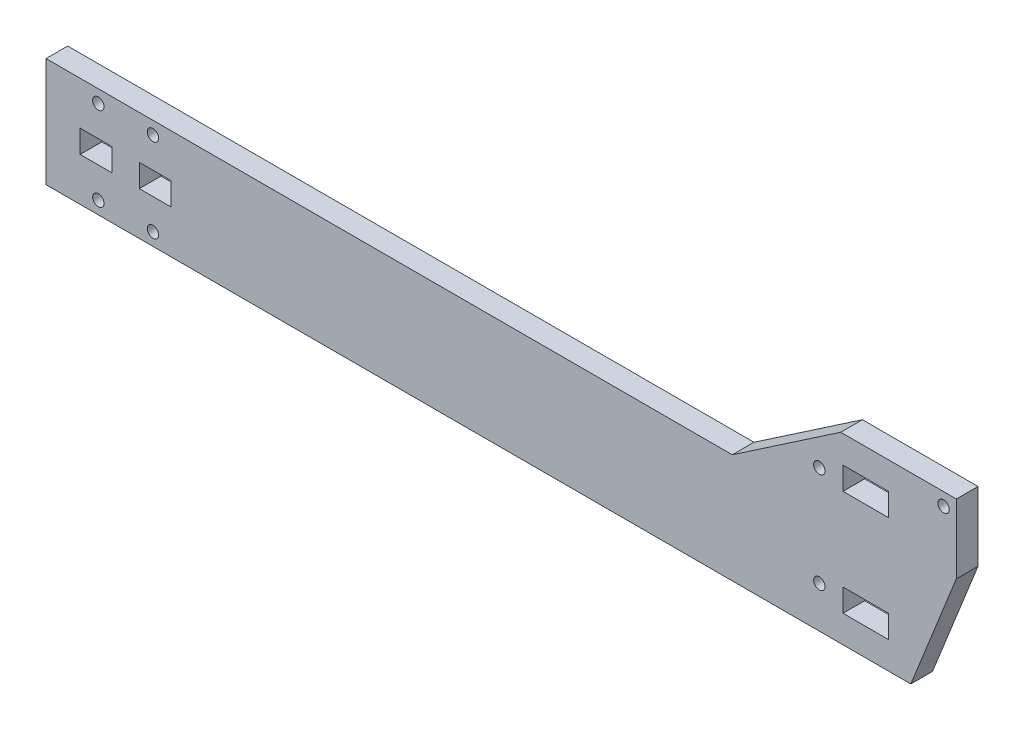
ISO-10303-21;
HEADER;
FILE_DESCRIPTION(('STEP AP214'),'2;1');
FILE_NAME('part.step','',(''),(''),'','','');
FILE_SCHEMA(('AUTOMOTIVE_DESIGN { 1 0 10303 214 1 1 1 1 }'));
ENDSEC;
DATA;
#1=APPLICATION_CONTEXT('core data for automotive mechanical design processes');
#2=APPLICATION_PROTOCOL_DEFINITION('international standard','automotive_design',2000,#1);
#3=PRODUCT_CONTEXT('',#1,'mechanical');
#4=PRODUCT('Part','Part','',(#3));
#5=PRODUCT_RELATED_PRODUCT_CATEGORY('part','',(#4));
#6=PRODUCT_DEFINITION_FORMATION('','',#4);
#7=PRODUCT_DEFINITION_CONTEXT('part definition',#1,'design');
#8=PRODUCT_DEFINITION('design','',#6,#7);
#9=PRODUCT_DEFINITION_SHAPE('','',#8);
#10=(LENGTH_UNIT() NAMED_UNIT(*) SI_UNIT(.MILLI.,.METRE.));
#11=(NAMED_UNIT(*) PLANE_ANGLE_UNIT() SI_UNIT($,.RADIAN.));
#12=(NAMED_UNIT(*) SI_UNIT($,.STERADIAN.) SOLID_ANGLE_UNIT());
#13=UNCERTAINTY_MEASURE_WITH_UNIT(LENGTH_MEASURE(1.E-05),#10,'distance_accuracy_value','');
#14=(GEOMETRIC_REPRESENTATION_CONTEXT(3) GLOBAL_UNCERTAINTY_ASSIGNED_CONTEXT((#13)) GLOBAL_UNIT_ASSIGNED_CONTEXT((#10,
#11,#12)) REPRESENTATION_CONTEXT('',''));
#15=CARTESIAN_POINT('',(0.,0.,0.));
#16=DIRECTION('',(0.,0.,1.));
#17=DIRECTION('',(1.,0.,0.));
#18=AXIS2_PLACEMENT_3D('',#15,#16,#17);
#19=CARTESIAN_POINT('',(0.,24.,4.7625));
#20=DIRECTION('',(1.,0.,0.));
#21=DIRECTION('',(0.,1.,0.));
#22=AXIS2_PLACEMENT_3D('',#19,#20,#21);
#23=PLANE('',#22);
#24=DIRECTION('',(0.,-1.,0.));
#25=VECTOR('',#24,1.);
#26=CARTESIAN_POINT('',(0.,24.,0.));
#27=LINE('',#26,#25);
#28=CARTESIAN_POINT('',(0.,24.,0.));
#29=VERTEX_POINT('',#28);
#30=CARTESIAN_POINT('',(0.,0.,0.));
#31=VERTEX_POINT('',#30);
#32=EDGE_CURVE('E318',#29,#31,#27,.T.);
#33=ORIENTED_EDGE('',*,*,#32,.T.);
#34=DIRECTION('',(0.,0.,-1.));
#35=VECTOR('',#34,1.);
#36=CARTESIAN_POINT('',(0.,0.,4.7625));
#37=LINE('',#36,#35);
#38=CARTESIAN_POINT('',(0.,0.,4.7625));
#39=VERTEX_POINT('',#38);
#40=EDGE_CURVE('E11',#39,#31,#37,.T.);
#41=ORIENTED_EDGE('',*,*,#40,.F.);
#42=DIRECTION('',(0.,-1.,0.));
#43=VECTOR('',#42,1.);
#44=CARTESIAN_POINT('',(0.,24.,4.7625));
#45=LINE('',#44,#43);
#46=CARTESIAN_POINT('',(0.,24.,4.7625));
#47=VERTEX_POINT('',#46);
#48=EDGE_CURVE('E325',#47,#39,#45,.T.);
#49=ORIENTED_EDGE('',*,*,#48,.F.);
#50=DIRECTION('',(0.,0.,-1.));
#51=VECTOR('',#50,1.);
#52=CARTESIAN_POINT('',(0.,24.,4.7625));
#53=LINE('',#52,#51);
#54=EDGE_CURVE('E341',#47,#29,#53,.T.);
#55=ORIENTED_EDGE('',*,*,#54,.T.);
#56=EDGE_LOOP('',(#33,#41,#49,#55));
#57=FACE_BOUND('',#56,.T.);
#58=ADVANCED_FACE('F34',(#57),#23,.F.);
#59=CARTESIAN_POINT('',(190.,0.,4.7625));
#60=DIRECTION('',(0.,1.,0.));
#61=DIRECTION('',(-1.,0.,0.));
#62=AXIS2_PLACEMENT_3D('',#59,#60,#61);
#63=PLANE('',#62);
#64=DIRECTION('',(1.,0.,0.));
#65=VECTOR('',#64,1.);
#66=CARTESIAN_POINT('',(190.,0.,0.));
#67=LINE('',#66,#65);
#68=CARTESIAN_POINT('',(190.,0.,0.));
#69=VERTEX_POINT('',#68);
#70=EDGE_CURVE('E344',#31,#69,#67,.T.);
#71=ORIENTED_EDGE('',*,*,#70,.T.);
#72=DIRECTION('',(0.,0.,-1.));
#73=VECTOR('',#72,1.);
#74=CARTESIAN_POINT('',(190.,0.,4.7625));
#75=LINE('',#74,#73);
#76=CARTESIAN_POINT('',(190.,0.,4.7625));
#77=VERTEX_POINT('',#76);
#78=EDGE_CURVE('E41',#77,#69,#75,.T.);
#79=ORIENTED_EDGE('',*,*,#78,.F.);
#80=DIRECTION('',(1.,0.,0.));
#81=VECTOR('',#80,1.);
#82=CARTESIAN_POINT('',(190.,0.,4.7625));
#83=LINE('',#82,#81);
#84=EDGE_CURVE('E328',#39,#77,#83,.T.);
#85=ORIENTED_EDGE('',*,*,#84,.F.);
#86=ORIENTED_EDGE('',*,*,#40,.T.);
#87=EDGE_LOOP('',(#71,#79,#85,#86));
#88=FACE_BOUND('',#87,.T.);
#89=ADVANCED_FACE('F395',(#88),#63,.F.);
#90=CARTESIAN_POINT('',(200.,25.,4.7625));
#91=DIRECTION('',(-0.928476690885259,0.371390676354104,0.));
#92=DIRECTION('',(-0.371390676354104,-0.928476690885259,0.));
#93=AXIS2_PLACEMENT_3D('',#90,#91,#92);
#94=PLANE('',#93);
#95=DIRECTION('',(0.371390676354104,0.928476690885259,0.));
#96=VECTOR('',#95,1.);
#97=CARTESIAN_POINT('',(200.,25.,0.));
#98=LINE('',#97,#96);
#99=CARTESIAN_POINT('',(200.,25.,0.));
#100=VERTEX_POINT('',#99);
#101=EDGE_CURVE('E346',#69,#100,#98,.T.);
#102=ORIENTED_EDGE('',*,*,#101,.T.);
#103=DIRECTION('',(0.,0.,-1.));
#104=VECTOR('',#103,1.);
#105=CARTESIAN_POINT('',(200.,25.,4.7625));
#106=LINE('',#105,#104);
#107=CARTESIAN_POINT('',(200.,25.,4.7625));
#108=VERTEX_POINT('',#107);
#109=EDGE_CURVE('E366',#108,#100,#106,.T.);
#110=ORIENTED_EDGE('',*,*,#109,.F.);
#111=DIRECTION('',(0.371390676354104,0.928476690885259,0.));
#112=VECTOR('',#111,1.);
#113=CARTESIAN_POINT('',(200.,25.,4.7625));
#114=LINE('',#113,#112);
#115=EDGE_CURVE('E331',#77,#108,#114,.T.);
#116=ORIENTED_EDGE('',*,*,#115,.F.);
#117=ORIENTED_EDGE('',*,*,#78,.T.);
#118=EDGE_LOOP('',(#102,#110,#116,#117));
#119=FACE_BOUND('',#118,.T.);
#120=ADVANCED_FACE('F373',(#119),#94,.F.);
#121=CARTESIAN_POINT('',(200.,40.2,4.7625));
#122=DIRECTION('',(-1.,0.,0.));
#123=DIRECTION('',(0.,0.,1.));
#124=AXIS2_PLACEMENT_3D('',#121,#122,#123);
#125=PLANE('',#124);
#126=DIRECTION('',(0.,1.,0.));
#127=VECTOR('',#126,1.);
#128=CARTESIAN_POINT('',(200.,40.2,0.));
#129=LINE('',#128,#127);
#130=CARTESIAN_POINT('',(200.,40.2,0.));
#131=VERTEX_POINT('',#130);
#132=EDGE_CURVE('E348',#100,#131,#129,.T.);
#133=ORIENTED_EDGE('',*,*,#132,.T.);
#134=DIRECTION('',(0.,0.,-1.));
#135=VECTOR('',#134,1.);
#136=CARTESIAN_POINT('',(200.,40.2,4.7625));
#137=LINE('',#136,#135);
#138=CARTESIAN_POINT('',(200.,40.2,4.7625));
#139=VERTEX_POINT('',#138);
#140=EDGE_CURVE('E363',#139,#131,#137,.T.);
#141=ORIENTED_EDGE('',*,*,#140,.F.);
#142=DIRECTION('',(0.,1.,0.));
#143=VECTOR('',#142,1.);
#144=CARTESIAN_POINT('',(200.,40.2,4.7625));
#145=LINE('',#144,#143);
#146=EDGE_CURVE('E333',#108,#139,#145,.T.);
#147=ORIENTED_EDGE('',*,*,#146,.F.);
#148=ORIENTED_EDGE('',*,*,#109,.T.);
#149=EDGE_LOOP('',(#133,#141,#147,#148));
#150=FACE_BOUND('',#149,.T.);
#151=ADVANCED_FACE('F383',(#150),#125,.F.);
#152=CARTESIAN_POINT('',(174.6,40.2,4.7625));
#153=DIRECTION('',(0.,-1.,0.));
#154=DIRECTION('',(0.,0.,-1.));
#155=AXIS2_PLACEMENT_3D('',#152,#153,#154);
#156=PLANE('',#155);
#157=DIRECTION('',(-1.,0.,0.));
#158=VECTOR('',#157,1.);
#159=CARTESIAN_POINT('',(174.6,40.2,0.));
#160=LINE('',#159,#158);
#161=CARTESIAN_POINT('',(174.6,40.2,0.));
#162=VERTEX_POINT('',#161);
#163=EDGE_CURVE('E350',#131,#162,#160,.T.);
#164=ORIENTED_EDGE('',*,*,#163,.T.);
#165=DIRECTION('',(0.,0.,-1.));
#166=VECTOR('',#165,1.);
#167=CARTESIAN_POINT('',(174.6,40.2,4.7625));
#168=LINE('',#167,#166);
#169=CARTESIAN_POINT('',(174.6,40.2,4.7625));
#170=VERTEX_POINT('',#169);
#171=EDGE_CURVE('E360',#170,#162,#168,.T.);
#172=ORIENTED_EDGE('',*,*,#171,.F.);
#173=DIRECTION('',(-1.,0.,0.));
#174=VECTOR('',#173,1.);
#175=CARTESIAN_POINT('',(174.6,40.2,4.7625));
#176=LINE('',#175,#174);
#177=EDGE_CURVE('E335',#139,#170,#176,.T.);
#178=ORIENTED_EDGE('',*,*,#177,.F.);
#179=ORIENTED_EDGE('',*,*,#140,.T.);
#180=EDGE_LOOP('',(#164,#172,#178,#179));
#181=FACE_BOUND('',#180,.T.);
#182=ADVANCED_FACE('F387',(#181),#156,.F.);
#183=CARTESIAN_POINT('',(174.6,40.2,4.7625));
#184=DIRECTION('',(0.562310021407278,-0.826926502069529,0.));
#185=DIRECTION('',(0.826926502069529,0.562310021407278,0.));
#186=AXIS2_PLACEMENT_3D('',#183,#184,#185);
#187=PLANE('',#186);
#188=DIRECTION('',(-0.826926502069529,-0.562310021407278,0.));
#189=VECTOR('',#188,1.);
#190=CARTESIAN_POINT('',(174.6,40.2,0.));
#191=LINE('',#190,#189);
#192=CARTESIAN_POINT('',(150.776470588235,24.,0.));
#193=VERTEX_POINT('',#192);
#194=EDGE_CURVE('E352',#162,#193,#191,.T.);
#195=ORIENTED_EDGE('',*,*,#194,.T.);
#196=DIRECTION('',(0.,0.,-1.));
#197=VECTOR('',#196,1.);
#198=CARTESIAN_POINT('',(150.776470588235,24.,4.7625));
#199=LINE('',#198,#197);
#200=CARTESIAN_POINT('',(150.776470588235,24.,4.7625));
#201=VERTEX_POINT('',#200);
#202=EDGE_CURVE('E357',#201,#193,#199,.T.);
#203=ORIENTED_EDGE('',*,*,#202,.F.);
#204=DIRECTION('',(-0.826926502069529,-0.562310021407278,0.));
#205=VECTOR('',#204,1.);
#206=CARTESIAN_POINT('',(174.6,40.2,4.7625));
#207=LINE('',#206,#205);
#208=EDGE_CURVE('E337',#170,#201,#207,.T.);
#209=ORIENTED_EDGE('',*,*,#208,.F.);
#210=ORIENTED_EDGE('',*,*,#171,.T.);
#211=EDGE_LOOP('',(#195,#203,#209,#210));
#212=FACE_BOUND('',#211,.T.);
#213=ADVANCED_FACE('F403',(#212),#187,.F.);
#214=CARTESIAN_POINT('',(150.776470588235,24.,4.7625));
#215=DIRECTION('',(0.,-1.,0.));
#216=DIRECTION('',(1.,0.,0.));
#217=AXIS2_PLACEMENT_3D('',#214,#215,#216);
#218=PLANE('',#217);
#219=DIRECTION('',(-1.,0.,0.));
#220=VECTOR('',#219,1.);
#221=CARTESIAN_POINT('',(150.776470588235,24.,0.));
#222=LINE('',#221,#220);
#223=EDGE_CURVE('E329',#193,#29,#222,.T.);
#224=ORIENTED_EDGE('',*,*,#223,.T.);
#225=ORIENTED_EDGE('',*,*,#54,.F.);
#226=DIRECTION('',(-1.,0.,0.));
#227=VECTOR('',#226,1.);
#228=CARTESIAN_POINT('',(150.776470588235,24.,4.7625));
#229=LINE('',#228,#227);
#230=EDGE_CURVE('E339',#201,#47,#229,.T.);
#231=ORIENTED_EDGE('',*,*,#230,.F.);
#232=ORIENTED_EDGE('',*,*,#202,.T.);
#233=EDGE_LOOP('',(#224,#225,#231,#232));
#234=FACE_BOUND('',#233,.T.);
#235=ADVANCED_FACE('F400',(#234),#218,.F.);
#236=CARTESIAN_POINT('',(0.,0.,4.7625));
#237=DIRECTION('',(0.,0.,-1.));
#238=DIRECTION('',(-1.,0.,0.));
#239=AXIS2_PLACEMENT_3D('',#236,#237,#238);
#240=PLANE('',#239);
#241=CARTESIAN_POINT('',(23.5,2.79999999999998,4.7625));
#242=DIRECTION('',(0.,0.,1.));
#243=DIRECTION('',(1.,0.,0.));
#244=AXIS2_PLACEMENT_3D('',#241,#242,#243);
#245=CIRCLE('',#244,1.25);
#246=CARTESIAN_POINT('',(24.75,2.79999999999998,4.7625));
#247=VERTEX_POINT('',#246);
#248=EDGE_CURVE('E693',#247,#247,#245,.T.);
#249=ORIENTED_EDGE('',*,*,#248,.F.);
#250=EDGE_LOOP('',(#249));
#251=FACE_BOUND('',#250,.T.);
#252=CARTESIAN_POINT('',(11.5,2.79999999999998,4.7625));
#253=DIRECTION('',(0.,0.,1.));
#254=DIRECTION('',(1.,0.,0.));
#255=AXIS2_PLACEMENT_3D('',#252,#253,#254);
#256=CIRCLE('',#255,1.25);
#257=CARTESIAN_POINT('',(12.75,2.79999999999998,4.7625));
#258=VERTEX_POINT('',#257);
#259=EDGE_CURVE('E695',#258,#258,#256,.T.);
#260=ORIENTED_EDGE('',*,*,#259,.F.);
#261=EDGE_LOOP('',(#260));
#262=FACE_BOUND('',#261,.T.);
#263=CARTESIAN_POINT('',(11.5,21.2,4.7625));
#264=DIRECTION('',(0.,0.,1.));
#265=DIRECTION('',(1.,0.,0.));
#266=AXIS2_PLACEMENT_3D('',#263,#264,#265);
#267=CIRCLE('',#266,1.25);
#268=CARTESIAN_POINT('',(12.75,21.2,4.7625));
#269=VERTEX_POINT('',#268);
#270=EDGE_CURVE('E701',#269,#269,#267,.T.);
#271=ORIENTED_EDGE('',*,*,#270,.F.);
#272=EDGE_LOOP('',(#271));
#273=FACE_BOUND('',#272,.T.);
#274=CARTESIAN_POINT('',(23.5,21.2,4.7625));
#275=DIRECTION('',(0.,0.,1.));
#276=DIRECTION('',(1.,0.,0.));
#277=AXIS2_PLACEMENT_3D('',#274,#275,#276);
#278=CIRCLE('',#277,1.25);
#279=CARTESIAN_POINT('',(24.75,21.2,4.7625));
#280=VERTEX_POINT('',#279);
#281=EDGE_CURVE('E707',#280,#280,#278,.T.);
#282=ORIENTED_EDGE('',*,*,#281,.F.);
#283=EDGE_LOOP('',(#282));
#284=FACE_BOUND('',#283,.T.);
#285=CARTESIAN_POINT('',(169.9,9.1,4.7625));
#286=DIRECTION('',(0.,0.,1.));
#287=DIRECTION('',(1.,0.,0.));
#288=AXIS2_PLACEMENT_3D('',#285,#286,#287);
#289=CIRCLE('',#288,1.25000000000001);
#290=CARTESIAN_POINT('',(171.15,9.1,4.7625));
#291=VERTEX_POINT('',#290);
#292=EDGE_CURVE('E713',#291,#291,#289,.T.);
#293=ORIENTED_EDGE('',*,*,#292,.F.);
#294=EDGE_LOOP('',(#293));
#295=FACE_BOUND('',#294,.T.);
#296=CARTESIAN_POINT('',(197.2,37.4,4.7625));
#297=DIRECTION('',(0.,0.,1.));
#298=DIRECTION('',(1.,0.,0.));
#299=AXIS2_PLACEMENT_3D('',#296,#297,#298);
#300=CIRCLE('',#299,1.25000000000001);
#301=CARTESIAN_POINT('',(198.45,37.4,4.7625));
#302=VERTEX_POINT('',#301);
#303=EDGE_CURVE('E719',#302,#302,#300,.T.);
#304=ORIENTED_EDGE('',*,*,#303,.F.);
#305=EDGE_LOOP('',(#304));
#306=FACE_BOUND('',#305,.T.);
#307=CARTESIAN_POINT('',(169.9,31.1,4.7625));
#308=DIRECTION('',(0.,0.,1.));
#309=DIRECTION('',(1.,0.,0.));
#310=AXIS2_PLACEMENT_3D('',#307,#308,#309);
#311=CIRCLE('',#310,1.25000000000001);
#312=CARTESIAN_POINT('',(171.15,31.1,4.7625));
#313=VERTEX_POINT('',#312);
#314=EDGE_CURVE('E212',#313,#313,#311,.T.);
#315=ORIENTED_EDGE('',*,*,#314,.F.);
#316=EDGE_LOOP('',(#315));
#317=FACE_BOUND('',#316,.T.);
#318=DIRECTION('',(-1.,0.,0.));
#319=VECTOR('',#318,1.);
#320=CARTESIAN_POINT('',(20.5,14.5,4.7625));
#321=LINE('',#320,#319);
#322=CARTESIAN_POINT('',(27.5,14.5,4.7625));
#323=VERTEX_POINT('',#322);
#324=CARTESIAN_POINT('',(20.5,14.5,4.7625));
#325=VERTEX_POINT('',#324);
#326=EDGE_CURVE('E218',#323,#325,#321,.T.);
#327=ORIENTED_EDGE('',*,*,#326,.F.);
#328=DIRECTION('',(0.,1.,0.));
#329=VECTOR('',#328,1.);
#330=CARTESIAN_POINT('',(27.5,14.5,4.7625));
#331=LINE('',#330,#329);
#332=CARTESIAN_POINT('',(27.5,9.5,4.7625));
#333=VERTEX_POINT('',#332);
#334=EDGE_CURVE('E48',#333,#323,#331,.T.);
#335=ORIENTED_EDGE('',*,*,#334,.F.);
#336=DIRECTION('',(1.,0.,0.));
#337=VECTOR('',#336,1.);
#338=CARTESIAN_POINT('',(20.5,9.5,4.7625));
#339=LINE('',#338,#337);
#340=CARTESIAN_POINT('',(20.5,9.5,4.7625));
#341=VERTEX_POINT('',#340);
#342=EDGE_CURVE('E206',#341,#333,#339,.T.);
#343=ORIENTED_EDGE('',*,*,#342,.F.);
#344=DIRECTION('',(0.,-1.,0.));
#345=VECTOR('',#344,1.);
#346=CARTESIAN_POINT('',(20.5,14.5,4.7625));
#347=LINE('',#346,#345);
#348=EDGE_CURVE('E209',#325,#341,#347,.T.);
#349=ORIENTED_EDGE('',*,*,#348,.F.);
#350=EDGE_LOOP('',(#327,#335,#343,#349));
#351=FACE_BOUND('',#350,.T.);
#352=DIRECTION('',(-1.,0.,0.));
#353=VECTOR('',#352,1.);
#354=CARTESIAN_POINT('',(7.5,14.5,4.7625));
#355=LINE('',#354,#353);
#356=CARTESIAN_POINT('',(14.5,14.5,4.7625));
#357=VERTEX_POINT('',#356);
#358=CARTESIAN_POINT('',(7.5,14.5,4.7625));
#359=VERTEX_POINT('',#358);
#360=EDGE_CURVE('E244',#357,#359,#355,.T.);
#361=ORIENTED_EDGE('',*,*,#360,.F.);
#362=DIRECTION('',(0.,1.,0.));
#363=VECTOR('',#362,1.);
#364=CARTESIAN_POINT('',(14.5,14.5,4.7625));
#365=LINE('',#364,#363);
#366=CARTESIAN_POINT('',(14.5,9.5,4.7625));
#367=VERTEX_POINT('',#366);
#368=EDGE_CURVE('E225',#367,#357,#365,.T.);
#369=ORIENTED_EDGE('',*,*,#368,.F.);
#370=DIRECTION('',(1.,0.,0.));
#371=VECTOR('',#370,1.);
#372=CARTESIAN_POINT('',(7.5,9.5,4.7625));
#373=LINE('',#372,#371);
#374=CARTESIAN_POINT('',(7.5,9.5,4.7625));
#375=VERTEX_POINT('',#374);
#376=EDGE_CURVE('E233',#375,#367,#373,.T.);
#377=ORIENTED_EDGE('',*,*,#376,.F.);
#378=DIRECTION('',(0.,-1.,0.));
#379=VECTOR('',#378,1.);
#380=CARTESIAN_POINT('',(7.5,14.5,4.7625));
#381=LINE('',#380,#379);
#382=EDGE_CURVE('E247',#359,#375,#381,.T.);
#383=ORIENTED_EDGE('',*,*,#382,.F.);
#384=EDGE_LOOP('',(#361,#369,#377,#383));
#385=FACE_BOUND('',#384,.T.);
#386=DIRECTION('',(-1.,0.,0.));
#387=VECTOR('',#386,1.);
#388=CARTESIAN_POINT('',(175.1,11.,4.7625));
#389=LINE('',#388,#387);
#390=CARTESIAN_POINT('',(185.1,11.,4.7625));
#391=VERTEX_POINT('',#390);
#392=CARTESIAN_POINT('',(175.1,11.,4.7625));
#393=VERTEX_POINT('',#392);
#394=EDGE_CURVE('E276',#391,#393,#389,.T.);
#395=ORIENTED_EDGE('',*,*,#394,.F.);
#396=DIRECTION('',(0.,1.,0.));
#397=VECTOR('',#396,1.);
#398=CARTESIAN_POINT('',(185.1,11.,4.7625));
#399=LINE('',#398,#397);
#400=CARTESIAN_POINT('',(185.1,6.,4.7625));
#401=VERTEX_POINT('',#400);
#402=EDGE_CURVE('E254',#401,#391,#399,.T.);
#403=ORIENTED_EDGE('',*,*,#402,.F.);
#404=DIRECTION('',(1.,0.,0.));
#405=VECTOR('',#404,1.);
#406=CARTESIAN_POINT('',(175.1,6.,4.7625));
#407=LINE('',#406,#405);
#408=CARTESIAN_POINT('',(175.1,6.,4.7625));
#409=VERTEX_POINT('',#408);
#410=EDGE_CURVE('E265',#409,#401,#407,.T.);
#411=ORIENTED_EDGE('',*,*,#410,.F.);
#412=DIRECTION('',(0.,-1.,0.));
#413=VECTOR('',#412,1.);
#414=CARTESIAN_POINT('',(175.1,11.,4.7625));
#415=LINE('',#414,#413);
#416=EDGE_CURVE('E279',#393,#409,#415,.T.);
#417=ORIENTED_EDGE('',*,*,#416,.F.);
#418=EDGE_LOOP('',(#395,#403,#411,#417));
#419=FACE_BOUND('',#418,.T.);
#420=DIRECTION('',(-1.,0.,0.));
#421=VECTOR('',#420,1.);
#422=CARTESIAN_POINT('',(175.1,34.2,4.7625));
#423=LINE('',#422,#421);
#424=CARTESIAN_POINT('',(185.1,34.2,4.7625));
#425=VERTEX_POINT('',#424);
#426=CARTESIAN_POINT('',(175.1,34.2,4.7625));
#427=VERTEX_POINT('',#426);
#428=EDGE_CURVE('E308',#425,#427,#423,.T.);
#429=ORIENTED_EDGE('',*,*,#428,.F.);
#430=DIRECTION('',(0.,1.,0.));
#431=VECTOR('',#430,1.);
#432=CARTESIAN_POINT('',(185.1,29.2,4.7625));
#433=LINE('',#432,#431);
#434=CARTESIAN_POINT('',(185.1,29.2,4.7625));
#435=VERTEX_POINT('',#434);
#436=EDGE_CURVE('E286',#435,#425,#433,.T.);
#437=ORIENTED_EDGE('',*,*,#436,.F.);
#438=DIRECTION('',(1.,0.,0.));
#439=VECTOR('',#438,1.);
#440=CARTESIAN_POINT('',(175.1,29.2,4.7625));
#441=LINE('',#440,#439);
#442=CARTESIAN_POINT('',(175.1,29.2,4.7625));
#443=VERTEX_POINT('',#442);
#444=EDGE_CURVE('E297',#443,#435,#441,.T.);
#445=ORIENTED_EDGE('',*,*,#444,.F.);
#446=DIRECTION('',(0.,-1.,0.));
#447=VECTOR('',#446,1.);
#448=CARTESIAN_POINT('',(175.1,29.2,4.7625));
#449=LINE('',#448,#447);
#450=EDGE_CURVE('E311',#427,#443,#449,.T.);
#451=ORIENTED_EDGE('',*,*,#450,.F.);
#452=EDGE_LOOP('',(#429,#437,#445,#451));
#453=FACE_BOUND('',#452,.T.);
#454=ORIENTED_EDGE('',*,*,#48,.T.);
#455=ORIENTED_EDGE('',*,*,#84,.T.);
#456=ORIENTED_EDGE('',*,*,#115,.T.);
#457=ORIENTED_EDGE('',*,*,#146,.T.);
#458=ORIENTED_EDGE('',*,*,#177,.T.);
#459=ORIENTED_EDGE('',*,*,#208,.T.);
#460=ORIENTED_EDGE('',*,*,#230,.T.);
#461=EDGE_LOOP('',(#454,#455,#456,#457,#458,#459,#460));
#462=FACE_BOUND('',#461,.T.);
#463=ADVANCED_FACE('F391',(#251,#262,#273,#284,#295,#306,#317,#351,#385,#419,#453,#462),#240,.F.);
#464=CARTESIAN_POINT('',(0.,0.,0.));
#465=DIRECTION('',(0.,0.,-1.));
#466=DIRECTION('',(-1.,0.,0.));
#467=AXIS2_PLACEMENT_3D('',#464,#465,#466);
#468=PLANE('',#467);
#469=CARTESIAN_POINT('',(23.5,2.79999999999998,0.));
#470=DIRECTION('',(0.,0.,1.));
#471=DIRECTION('',(1.,0.,0.));
#472=AXIS2_PLACEMENT_3D('',#469,#470,#471);
#473=CIRCLE('',#472,1.25);
#474=CARTESIAN_POINT('',(24.75,2.79999999999998,0.));
#475=VERTEX_POINT('',#474);
#476=EDGE_CURVE('E690',#475,#475,#473,.T.);
#477=ORIENTED_EDGE('',*,*,#476,.T.);
#478=EDGE_LOOP('',(#477));
#479=FACE_BOUND('',#478,.T.);
#480=CARTESIAN_POINT('',(11.5,2.79999999999998,0.));
#481=DIRECTION('',(0.,0.,1.));
#482=DIRECTION('',(1.,0.,0.));
#483=AXIS2_PLACEMENT_3D('',#480,#481,#482);
#484=CIRCLE('',#483,1.25);
#485=CARTESIAN_POINT('',(12.75,2.79999999999998,0.));
#486=VERTEX_POINT('',#485);
#487=EDGE_CURVE('E698',#486,#486,#484,.T.);
#488=ORIENTED_EDGE('',*,*,#487,.T.);
#489=EDGE_LOOP('',(#488));
#490=FACE_BOUND('',#489,.T.);
#491=CARTESIAN_POINT('',(11.5,21.2,0.));
#492=DIRECTION('',(0.,0.,1.));
#493=DIRECTION('',(1.,0.,0.));
#494=AXIS2_PLACEMENT_3D('',#491,#492,#493);
#495=CIRCLE('',#494,1.25);
#496=CARTESIAN_POINT('',(12.75,21.2,0.));
#497=VERTEX_POINT('',#496);
#498=EDGE_CURVE('E704',#497,#497,#495,.T.);
#499=ORIENTED_EDGE('',*,*,#498,.T.);
#500=EDGE_LOOP('',(#499));
#501=FACE_BOUND('',#500,.T.);
#502=CARTESIAN_POINT('',(23.5,21.2,0.));
#503=DIRECTION('',(0.,0.,1.));
#504=DIRECTION('',(1.,0.,0.));
#505=AXIS2_PLACEMENT_3D('',#502,#503,#504);
#506=CIRCLE('',#505,1.25);
#507=CARTESIAN_POINT('',(24.75,21.2,0.));
#508=VERTEX_POINT('',#507);
#509=EDGE_CURVE('E710',#508,#508,#506,.T.);
#510=ORIENTED_EDGE('',*,*,#509,.T.);
#511=EDGE_LOOP('',(#510));
#512=FACE_BOUND('',#511,.T.);
#513=CARTESIAN_POINT('',(169.9,9.1,0.));
#514=DIRECTION('',(0.,0.,1.));
#515=DIRECTION('',(1.,0.,0.));
#516=AXIS2_PLACEMENT_3D('',#513,#514,#515);
#517=CIRCLE('',#516,1.25000000000001);
#518=CARTESIAN_POINT('',(171.15,9.1,0.));
#519=VERTEX_POINT('',#518);
#520=EDGE_CURVE('E716',#519,#519,#517,.T.);
#521=ORIENTED_EDGE('',*,*,#520,.T.);
#522=EDGE_LOOP('',(#521));
#523=FACE_BOUND('',#522,.T.);
#524=CARTESIAN_POINT('',(197.2,37.4,0.));
#525=DIRECTION('',(0.,0.,1.));
#526=DIRECTION('',(1.,0.,0.));
#527=AXIS2_PLACEMENT_3D('',#524,#525,#526);
#528=CIRCLE('',#527,1.25000000000001);
#529=CARTESIAN_POINT('',(198.45,37.4,0.));
#530=VERTEX_POINT('',#529);
#531=EDGE_CURVE('E722',#530,#530,#528,.T.);
#532=ORIENTED_EDGE('',*,*,#531,.T.);
#533=EDGE_LOOP('',(#532));
#534=FACE_BOUND('',#533,.T.);
#535=CARTESIAN_POINT('',(169.9,31.1,0.));
#536=DIRECTION('',(0.,0.,1.));
#537=DIRECTION('',(1.,0.,0.));
#538=AXIS2_PLACEMENT_3D('',#535,#536,#537);
#539=CIRCLE('',#538,1.25000000000001);
#540=CARTESIAN_POINT('',(171.15,31.1,0.));
#541=VERTEX_POINT('',#540);
#542=EDGE_CURVE('E219',#541,#541,#539,.T.);
#543=ORIENTED_EDGE('',*,*,#542,.T.);
#544=EDGE_LOOP('',(#543));
#545=FACE_BOUND('',#544,.T.);
#546=DIRECTION('',(0.,1.,0.));
#547=VECTOR('',#546,1.);
#548=CARTESIAN_POINT('',(27.5,14.5,0.));
#549=LINE('',#548,#547);
#550=CARTESIAN_POINT('',(27.5,9.5,0.));
#551=VERTEX_POINT('',#550);
#552=CARTESIAN_POINT('',(27.5,14.5,0.));
#553=VERTEX_POINT('',#552);
#554=EDGE_CURVE('E190',#551,#553,#549,.T.);
#555=ORIENTED_EDGE('',*,*,#554,.T.);
#556=DIRECTION('',(-1.,0.,0.));
#557=VECTOR('',#556,1.);
#558=CARTESIAN_POINT('',(20.5,14.5,0.));
#559=LINE('',#558,#557);
#560=CARTESIAN_POINT('',(20.5,14.5,0.));
#561=VERTEX_POINT('',#560);
#562=EDGE_CURVE('E199',#553,#561,#559,.T.);
#563=ORIENTED_EDGE('',*,*,#562,.T.);
#564=DIRECTION('',(0.,-1.,0.));
#565=VECTOR('',#564,1.);
#566=CARTESIAN_POINT('',(20.5,14.5,0.));
#567=LINE('',#566,#565);
#568=CARTESIAN_POINT('',(20.5,9.5,0.));
#569=VERTEX_POINT('',#568);
#570=EDGE_CURVE('E56',#561,#569,#567,.T.);
#571=ORIENTED_EDGE('',*,*,#570,.T.);
#572=DIRECTION('',(1.,0.,0.));
#573=VECTOR('',#572,1.);
#574=CARTESIAN_POINT('',(20.5,9.5,0.));
#575=LINE('',#574,#573);
#576=EDGE_CURVE('E196',#569,#551,#575,.T.);
#577=ORIENTED_EDGE('',*,*,#576,.T.);
#578=EDGE_LOOP('',(#555,#563,#571,#577));
#579=FACE_BOUND('',#578,.T.);
#580=DIRECTION('',(0.,1.,0.));
#581=VECTOR('',#580,1.);
#582=CARTESIAN_POINT('',(14.5,14.5,0.));
#583=LINE('',#582,#581);
#584=CARTESIAN_POINT('',(14.5,9.5,0.));
#585=VERTEX_POINT('',#584);
#586=CARTESIAN_POINT('',(14.5,14.5,0.));
#587=VERTEX_POINT('',#586);
#588=EDGE_CURVE('E229',#585,#587,#583,.T.);
#589=ORIENTED_EDGE('',*,*,#588,.T.);
#590=DIRECTION('',(-1.,0.,0.));
#591=VECTOR('',#590,1.);
#592=CARTESIAN_POINT('',(7.5,14.5,0.));
#593=LINE('',#592,#591);
#594=CARTESIAN_POINT('',(7.5,14.5,0.));
#595=VERTEX_POINT('',#594);
#596=EDGE_CURVE('E232',#587,#595,#593,.T.);
#597=ORIENTED_EDGE('',*,*,#596,.T.);
#598=DIRECTION('',(0.,-1.,0.));
#599=VECTOR('',#598,1.);
#600=CARTESIAN_POINT('',(7.5,14.5,0.));
#601=LINE('',#600,#599);
#602=CARTESIAN_POINT('',(7.5,9.5,0.));
#603=VERTEX_POINT('',#602);
#604=EDGE_CURVE('E236',#595,#603,#601,.T.);
#605=ORIENTED_EDGE('',*,*,#604,.T.);
#606=DIRECTION('',(1.,0.,0.));
#607=VECTOR('',#606,1.);
#608=CARTESIAN_POINT('',(7.5,9.5,0.));
#609=LINE('',#608,#607);
#610=EDGE_CURVE('E239',#603,#585,#609,.T.);
#611=ORIENTED_EDGE('',*,*,#610,.T.);
#612=EDGE_LOOP('',(#589,#597,#605,#611));
#613=FACE_BOUND('',#612,.T.);
#614=DIRECTION('',(0.,1.,0.));
#615=VECTOR('',#614,1.);
#616=CARTESIAN_POINT('',(185.1,11.,0.));
#617=LINE('',#616,#615);
#618=CARTESIAN_POINT('',(185.1,6.,0.));
#619=VERTEX_POINT('',#618);
#620=CARTESIAN_POINT('',(185.1,11.,0.));
#621=VERTEX_POINT('',#620);
#622=EDGE_CURVE('E261',#619,#621,#617,.T.);
#623=ORIENTED_EDGE('',*,*,#622,.T.);
#624=DIRECTION('',(-1.,0.,0.));
#625=VECTOR('',#624,1.);
#626=CARTESIAN_POINT('',(175.1,11.,0.));
#627=LINE('',#626,#625);
#628=CARTESIAN_POINT('',(175.1,11.,0.));
#629=VERTEX_POINT('',#628);
#630=EDGE_CURVE('E264',#621,#629,#627,.T.);
#631=ORIENTED_EDGE('',*,*,#630,.T.);
#632=DIRECTION('',(0.,-1.,0.));
#633=VECTOR('',#632,1.);
#634=CARTESIAN_POINT('',(175.1,11.,0.));
#635=LINE('',#634,#633);
#636=CARTESIAN_POINT('',(175.1,6.,0.));
#637=VERTEX_POINT('',#636);
#638=EDGE_CURVE('E268',#629,#637,#635,.T.);
#639=ORIENTED_EDGE('',*,*,#638,.T.);
#640=DIRECTION('',(1.,0.,0.));
#641=VECTOR('',#640,1.);
#642=CARTESIAN_POINT('',(175.1,6.,0.));
#643=LINE('',#642,#641);
#644=EDGE_CURVE('E271',#637,#619,#643,.T.);
#645=ORIENTED_EDGE('',*,*,#644,.T.);
#646=EDGE_LOOP('',(#623,#631,#639,#645));
#647=FACE_BOUND('',#646,.T.);
#648=DIRECTION('',(0.,1.,0.));
#649=VECTOR('',#648,1.);
#650=CARTESIAN_POINT('',(185.1,29.2,0.));
#651=LINE('',#650,#649);
#652=CARTESIAN_POINT('',(185.1,29.2,0.));
#653=VERTEX_POINT('',#652);
#654=CARTESIAN_POINT('',(185.1,34.2,0.));
#655=VERTEX_POINT('',#654);
#656=EDGE_CURVE('E293',#653,#655,#651,.T.);
#657=ORIENTED_EDGE('',*,*,#656,.T.);
#658=DIRECTION('',(-1.,0.,0.));
#659=VECTOR('',#658,1.);
#660=CARTESIAN_POINT('',(175.1,34.2,0.));
#661=LINE('',#660,#659);
#662=CARTESIAN_POINT('',(175.1,34.2,0.));
#663=VERTEX_POINT('',#662);
#664=EDGE_CURVE('E296',#655,#663,#661,.T.);
#665=ORIENTED_EDGE('',*,*,#664,.T.);
#666=DIRECTION('',(0.,-1.,0.));
#667=VECTOR('',#666,1.);
#668=CARTESIAN_POINT('',(175.1,29.2,0.));
#669=LINE('',#668,#667);
#670=CARTESIAN_POINT('',(175.1,29.2,0.));
#671=VERTEX_POINT('',#670);
#672=EDGE_CURVE('E300',#663,#671,#669,.T.);
#673=ORIENTED_EDGE('',*,*,#672,.T.);
#674=DIRECTION('',(1.,0.,0.));
#675=VECTOR('',#674,1.);
#676=CARTESIAN_POINT('',(175.1,29.2,0.));
#677=LINE('',#676,#675);
#678=EDGE_CURVE('E303',#671,#653,#677,.T.);
#679=ORIENTED_EDGE('',*,*,#678,.T.);
#680=EDGE_LOOP('',(#657,#665,#673,#679));
#681=FACE_BOUND('',#680,.T.);
#682=ORIENTED_EDGE('',*,*,#32,.F.);
#683=ORIENTED_EDGE('',*,*,#223,.F.);
#684=ORIENTED_EDGE('',*,*,#194,.F.);
#685=ORIENTED_EDGE('',*,*,#163,.F.);
#686=ORIENTED_EDGE('',*,*,#132,.F.);
#687=ORIENTED_EDGE('',*,*,#101,.F.);
#688=ORIENTED_EDGE('',*,*,#70,.F.);
#689=EDGE_LOOP('',(#682,#683,#684,#685,#686,#687,#688));
#690=FACE_BOUND('',#689,.T.);
#691=ADVANCED_FACE('F203',(#479,#490,#501,#512,#523,#534,#545,#579,#613,#647,#681,#690),#468,.T.);
#692=CARTESIAN_POINT('',(185.1,29.2,0.));
#693=DIRECTION('',(1.,0.,0.));
#694=DIRECTION('',(0.,0.,-1.));
#695=AXIS2_PLACEMENT_3D('',#692,#693,#694);
#696=PLANE('',#695);
#697=ORIENTED_EDGE('',*,*,#436,.T.);
#698=DIRECTION('',(0.,0.,1.));
#699=VECTOR('',#698,1.);
#700=CARTESIAN_POINT('',(185.1,34.2,0.));
#701=LINE('',#700,#699);
#702=EDGE_CURVE('E306',#655,#425,#701,.T.);
#703=ORIENTED_EDGE('',*,*,#702,.F.);
#704=ORIENTED_EDGE('',*,*,#656,.F.);
#705=DIRECTION('',(0.,0.,1.));
#706=VECTOR('',#705,1.);
#707=CARTESIAN_POINT('',(185.1,29.2,0.));
#708=LINE('',#707,#706);
#709=EDGE_CURVE('E316',#653,#435,#708,.T.);
#710=ORIENTED_EDGE('',*,*,#709,.T.);
#711=EDGE_LOOP('',(#697,#703,#704,#710));
#712=FACE_BOUND('',#711,.T.);
#713=ADVANCED_FACE('F458',(#712),#696,.F.);
#714=CARTESIAN_POINT('',(175.1,29.2,0.));
#715=DIRECTION('',(0.,-1.,0.));
#716=DIRECTION('',(0.,0.,-1.));
#717=AXIS2_PLACEMENT_3D('',#714,#715,#716);
#718=PLANE('',#717);
#719=ORIENTED_EDGE('',*,*,#444,.T.);
#720=ORIENTED_EDGE('',*,*,#709,.F.);
#721=ORIENTED_EDGE('',*,*,#678,.F.);
#722=DIRECTION('',(0.,0.,1.));
#723=VECTOR('',#722,1.);
#724=CARTESIAN_POINT('',(175.1,29.2,0.));
#725=LINE('',#724,#723);
#726=EDGE_CURVE('E319',#671,#443,#725,.T.);
#727=ORIENTED_EDGE('',*,*,#726,.T.);
#728=EDGE_LOOP('',(#719,#720,#721,#727));
#729=FACE_BOUND('',#728,.T.);
#730=ADVANCED_FACE('F468',(#729),#718,.F.);
#731=CARTESIAN_POINT('',(175.1,29.2,0.));
#732=DIRECTION('',(-1.,0.,0.));
#733=DIRECTION('',(0.,0.,1.));
#734=AXIS2_PLACEMENT_3D('',#731,#732,#733);
#735=PLANE('',#734);
#736=ORIENTED_EDGE('',*,*,#450,.T.);
#737=ORIENTED_EDGE('',*,*,#726,.F.);
#738=ORIENTED_EDGE('',*,*,#672,.F.);
#739=DIRECTION('',(0.,0.,1.));
#740=VECTOR('',#739,1.);
#741=CARTESIAN_POINT('',(175.1,34.2,0.));
#742=LINE('',#741,#740);
#743=EDGE_CURVE('E321',#663,#427,#742,.T.);
#744=ORIENTED_EDGE('',*,*,#743,.T.);
#745=EDGE_LOOP('',(#736,#737,#738,#744));
#746=FACE_BOUND('',#745,.T.);
#747=ADVANCED_FACE('F478',(#746),#735,.F.);
#748=CARTESIAN_POINT('',(175.1,34.2,0.));
#749=DIRECTION('',(0.,1.,0.));
#750=DIRECTION('',(-1.,0.,0.));
#751=AXIS2_PLACEMENT_3D('',#748,#749,#750);
#752=PLANE('',#751);
#753=ORIENTED_EDGE('',*,*,#428,.T.);
#754=ORIENTED_EDGE('',*,*,#743,.F.);
#755=ORIENTED_EDGE('',*,*,#664,.F.);
#756=ORIENTED_EDGE('',*,*,#702,.T.);
#757=EDGE_LOOP('',(#753,#754,#755,#756));
#758=FACE_BOUND('',#757,.T.);
#759=ADVANCED_FACE('F488',(#758),#752,.F.);
#760=CARTESIAN_POINT('',(185.1,11.,0.));
#761=DIRECTION('',(1.,0.,0.));
#762=DIRECTION('',(0.,0.,-1.));
#763=AXIS2_PLACEMENT_3D('',#760,#761,#762);
#764=PLANE('',#763);
#765=ORIENTED_EDGE('',*,*,#402,.T.);
#766=DIRECTION('',(0.,0.,1.));
#767=VECTOR('',#766,1.);
#768=CARTESIAN_POINT('',(185.1,11.,0.));
#769=LINE('',#768,#767);
#770=EDGE_CURVE('E274',#621,#391,#769,.T.);
#771=ORIENTED_EDGE('',*,*,#770,.F.);
#772=ORIENTED_EDGE('',*,*,#622,.F.);
#773=DIRECTION('',(0.,0.,1.));
#774=VECTOR('',#773,1.);
#775=CARTESIAN_POINT('',(185.1,6.,0.));
#776=LINE('',#775,#774);
#777=EDGE_CURVE('E284',#619,#401,#776,.T.);
#778=ORIENTED_EDGE('',*,*,#777,.T.);
#779=EDGE_LOOP('',(#765,#771,#772,#778));
#780=FACE_BOUND('',#779,.T.);
#781=ADVANCED_FACE('F498',(#780),#764,.F.);
#782=CARTESIAN_POINT('',(175.1,6.,0.));
#783=DIRECTION('',(0.,-1.,0.));
#784=DIRECTION('',(0.,0.,-1.));
#785=AXIS2_PLACEMENT_3D('',#782,#783,#784);
#786=PLANE('',#785);
#787=ORIENTED_EDGE('',*,*,#410,.T.);
#788=ORIENTED_EDGE('',*,*,#777,.F.);
#789=ORIENTED_EDGE('',*,*,#644,.F.);
#790=DIRECTION('',(0.,0.,1.));
#791=VECTOR('',#790,1.);
#792=CARTESIAN_POINT('',(175.1,6.,0.));
#793=LINE('',#792,#791);
#794=EDGE_CURVE('E287',#637,#409,#793,.T.);
#795=ORIENTED_EDGE('',*,*,#794,.T.);
#796=EDGE_LOOP('',(#787,#788,#789,#795));
#797=FACE_BOUND('',#796,.T.);
#798=ADVANCED_FACE('F508',(#797),#786,.F.);
#799=CARTESIAN_POINT('',(175.1,11.,0.));
#800=DIRECTION('',(-1.,0.,0.));
#801=DIRECTION('',(0.,0.,1.));
#802=AXIS2_PLACEMENT_3D('',#799,#800,#801);
#803=PLANE('',#802);
#804=ORIENTED_EDGE('',*,*,#416,.T.);
#805=ORIENTED_EDGE('',*,*,#794,.F.);
#806=ORIENTED_EDGE('',*,*,#638,.F.);
#807=DIRECTION('',(0.,0.,1.));
#808=VECTOR('',#807,1.);
#809=CARTESIAN_POINT('',(175.1,11.,0.));
#810=LINE('',#809,#808);
#811=EDGE_CURVE('E289',#629,#393,#810,.T.);
#812=ORIENTED_EDGE('',*,*,#811,.T.);
#813=EDGE_LOOP('',(#804,#805,#806,#812));
#814=FACE_BOUND('',#813,.T.);
#815=ADVANCED_FACE('F518',(#814),#803,.F.);
#816=CARTESIAN_POINT('',(175.1,11.,0.));
#817=DIRECTION('',(0.,1.,0.));
#818=DIRECTION('',(0.,0.,1.));
#819=AXIS2_PLACEMENT_3D('',#816,#817,#818);
#820=PLANE('',#819);
#821=ORIENTED_EDGE('',*,*,#394,.T.);
#822=ORIENTED_EDGE('',*,*,#811,.F.);
#823=ORIENTED_EDGE('',*,*,#630,.F.);
#824=ORIENTED_EDGE('',*,*,#770,.T.);
#825=EDGE_LOOP('',(#821,#822,#823,#824));
#826=FACE_BOUND('',#825,.T.);
#827=ADVANCED_FACE('F528',(#826),#820,.F.);
#828=CARTESIAN_POINT('',(14.5,14.5,0.));
#829=DIRECTION('',(1.,0.,0.));
#830=DIRECTION('',(0.,0.,-1.));
#831=AXIS2_PLACEMENT_3D('',#828,#829,#830);
#832=PLANE('',#831);
#833=ORIENTED_EDGE('',*,*,#368,.T.);
#834=DIRECTION('',(0.,0.,1.));
#835=VECTOR('',#834,1.);
#836=CARTESIAN_POINT('',(14.5,14.5,0.));
#837=LINE('',#836,#835);
#838=EDGE_CURVE('E242',#587,#357,#837,.T.);
#839=ORIENTED_EDGE('',*,*,#838,.F.);
#840=ORIENTED_EDGE('',*,*,#588,.F.);
#841=DIRECTION('',(0.,0.,1.));
#842=VECTOR('',#841,1.);
#843=CARTESIAN_POINT('',(14.5,9.5,0.));
#844=LINE('',#843,#842);
#845=EDGE_CURVE('E252',#585,#367,#844,.T.);
#846=ORIENTED_EDGE('',*,*,#845,.T.);
#847=EDGE_LOOP('',(#833,#839,#840,#846));
#848=FACE_BOUND('',#847,.T.);
#849=ADVANCED_FACE('F538',(#848),#832,.F.);
#850=CARTESIAN_POINT('',(7.5,9.5,0.));
#851=DIRECTION('',(0.,-1.,0.));
#852=DIRECTION('',(0.,0.,-1.));
#853=AXIS2_PLACEMENT_3D('',#850,#851,#852);
#854=PLANE('',#853);
#855=ORIENTED_EDGE('',*,*,#376,.T.);
#856=ORIENTED_EDGE('',*,*,#845,.F.);
#857=ORIENTED_EDGE('',*,*,#610,.F.);
#858=DIRECTION('',(0.,0.,1.));
#859=VECTOR('',#858,1.);
#860=CARTESIAN_POINT('',(7.5,9.5,0.));
#861=LINE('',#860,#859);
#862=EDGE_CURVE('E255',#603,#375,#861,.T.);
#863=ORIENTED_EDGE('',*,*,#862,.T.);
#864=EDGE_LOOP('',(#855,#856,#857,#863));
#865=FACE_BOUND('',#864,.T.);
#866=ADVANCED_FACE('F548',(#865),#854,.F.);
#867=CARTESIAN_POINT('',(7.5,14.5,0.));
#868=DIRECTION('',(-1.,0.,0.));
#869=DIRECTION('',(0.,-1.,0.));
#870=AXIS2_PLACEMENT_3D('',#867,#868,#869);
#871=PLANE('',#870);
#872=ORIENTED_EDGE('',*,*,#382,.T.);
#873=ORIENTED_EDGE('',*,*,#862,.F.);
#874=ORIENTED_EDGE('',*,*,#604,.F.);
#875=DIRECTION('',(0.,0.,1.));
#876=VECTOR('',#875,1.);
#877=CARTESIAN_POINT('',(7.5,14.5,0.));
#878=LINE('',#877,#876);
#879=EDGE_CURVE('E257',#595,#359,#878,.T.);
#880=ORIENTED_EDGE('',*,*,#879,.T.);
#881=EDGE_LOOP('',(#872,#873,#874,#880));
#882=FACE_BOUND('',#881,.T.);
#883=ADVANCED_FACE('F558',(#882),#871,.F.);
#884=CARTESIAN_POINT('',(7.5,14.5,0.));
#885=DIRECTION('',(0.,1.,0.));
#886=DIRECTION('',(0.,0.,1.));
#887=AXIS2_PLACEMENT_3D('',#884,#885,#886);
#888=PLANE('',#887);
#889=ORIENTED_EDGE('',*,*,#360,.T.);
#890=ORIENTED_EDGE('',*,*,#879,.F.);
#891=ORIENTED_EDGE('',*,*,#596,.F.);
#892=ORIENTED_EDGE('',*,*,#838,.T.);
#893=EDGE_LOOP('',(#889,#890,#891,#892));
#894=FACE_BOUND('',#893,.T.);
#895=ADVANCED_FACE('F568',(#894),#888,.F.);
#896=CARTESIAN_POINT('',(27.5,14.5,0.));
#897=DIRECTION('',(1.,0.,0.));
#898=DIRECTION('',(0.,0.,-1.));
#899=AXIS2_PLACEMENT_3D('',#896,#897,#898);
#900=PLANE('',#899);
#901=ORIENTED_EDGE('',*,*,#334,.T.);
#902=DIRECTION('',(0.,0.,1.));
#903=VECTOR('',#902,1.);
#904=CARTESIAN_POINT('',(27.5,14.5,0.));
#905=LINE('',#904,#903);
#906=EDGE_CURVE('E186',#553,#323,#905,.T.);
#907=ORIENTED_EDGE('',*,*,#906,.F.);
#908=ORIENTED_EDGE('',*,*,#554,.F.);
#909=DIRECTION('',(0.,0.,1.));
#910=VECTOR('',#909,1.);
#911=CARTESIAN_POINT('',(27.5,9.5,0.));
#912=LINE('',#911,#910);
#913=EDGE_CURVE('E223',#551,#333,#912,.T.);
#914=ORIENTED_EDGE('',*,*,#913,.T.);
#915=EDGE_LOOP('',(#901,#907,#908,#914));
#916=FACE_BOUND('',#915,.T.);
#917=ADVANCED_FACE('F188',(#916),#900,.F.);
#918=CARTESIAN_POINT('',(20.5,9.5,0.));
#919=DIRECTION('',(0.,-1.,0.));
#920=DIRECTION('',(0.,0.,-1.));
#921=AXIS2_PLACEMENT_3D('',#918,#919,#920);
#922=PLANE('',#921);
#923=ORIENTED_EDGE('',*,*,#342,.T.);
#924=ORIENTED_EDGE('',*,*,#913,.F.);
#925=ORIENTED_EDGE('',*,*,#576,.F.);
#926=DIRECTION('',(0.,0.,1.));
#927=VECTOR('',#926,1.);
#928=CARTESIAN_POINT('',(20.5,9.5,0.));
#929=LINE('',#928,#927);
#930=EDGE_CURVE('E226',#569,#341,#929,.T.);
#931=ORIENTED_EDGE('',*,*,#930,.T.);
#932=EDGE_LOOP('',(#923,#924,#925,#931));
#933=FACE_BOUND('',#932,.T.);
#934=ADVANCED_FACE('F587',(#933),#922,.F.);
#935=CARTESIAN_POINT('',(20.5,14.5,0.));
#936=DIRECTION('',(-1.,0.,0.));
#937=DIRECTION('',(0.,0.,1.));
#938=AXIS2_PLACEMENT_3D('',#935,#936,#937);
#939=PLANE('',#938);
#940=ORIENTED_EDGE('',*,*,#348,.T.);
#941=ORIENTED_EDGE('',*,*,#930,.F.);
#942=ORIENTED_EDGE('',*,*,#570,.F.);
#943=DIRECTION('',(0.,0.,1.));
#944=VECTOR('',#943,1.);
#945=CARTESIAN_POINT('',(20.5,14.5,0.));
#946=LINE('',#945,#944);
#947=EDGE_CURVE('E195',#561,#325,#946,.T.);
#948=ORIENTED_EDGE('',*,*,#947,.T.);
#949=EDGE_LOOP('',(#940,#941,#942,#948));
#950=FACE_BOUND('',#949,.T.);
#951=ADVANCED_FACE('F596',(#950),#939,.F.);
#952=CARTESIAN_POINT('',(20.5,14.5,0.));
#953=DIRECTION('',(0.,1.,0.));
#954=DIRECTION('',(0.,0.,1.));
#955=AXIS2_PLACEMENT_3D('',#952,#953,#954);
#956=PLANE('',#955);
#957=ORIENTED_EDGE('',*,*,#326,.T.);
#958=ORIENTED_EDGE('',*,*,#947,.F.);
#959=ORIENTED_EDGE('',*,*,#562,.F.);
#960=ORIENTED_EDGE('',*,*,#906,.T.);
#961=EDGE_LOOP('',(#957,#958,#959,#960));
#962=FACE_BOUND('',#961,.T.);
#963=ADVANCED_FACE('F200',(#962),#956,.F.);
#964=CARTESIAN_POINT('',(169.9,31.1,0.));
#965=DIRECTION('',(0.,0.,1.));
#966=DIRECTION('',(1.,0.,0.));
#967=AXIS2_PLACEMENT_3D('',#964,#965,#966);
#968=CYLINDRICAL_SURFACE('',#967,1.25000000000001);
#969=ORIENTED_EDGE('',*,*,#542,.F.);
#970=EDGE_LOOP('',(#969));
#971=FACE_BOUND('',#970,.T.);
#972=ORIENTED_EDGE('',*,*,#314,.T.);
#973=EDGE_LOOP('',(#972));
#974=FACE_BOUND('',#973,.T.);
#975=ADVANCED_FACE('F614',(#971,#974),#968,.F.);
#976=CARTESIAN_POINT('',(197.2,37.4,0.));
#977=DIRECTION('',(0.,0.,1.));
#978=DIRECTION('',(1.,0.,0.));
#979=AXIS2_PLACEMENT_3D('',#976,#977,#978);
#980=CYLINDRICAL_SURFACE('',#979,1.25000000000001);
#981=ORIENTED_EDGE('',*,*,#531,.F.);
#982=EDGE_LOOP('',(#981));
#983=FACE_BOUND('',#982,.T.);
#984=ORIENTED_EDGE('',*,*,#303,.T.);
#985=EDGE_LOOP('',(#984));
#986=FACE_BOUND('',#985,.T.);
#987=ADVANCED_FACE('F623',(#983,#986),#980,.F.);
#988=CARTESIAN_POINT('',(169.9,9.1,0.));
#989=DIRECTION('',(0.,0.,1.));
#990=DIRECTION('',(1.,0.,0.));
#991=AXIS2_PLACEMENT_3D('',#988,#989,#990);
#992=CYLINDRICAL_SURFACE('',#991,1.25000000000001);
#993=ORIENTED_EDGE('',*,*,#520,.F.);
#994=EDGE_LOOP('',(#993));
#995=FACE_BOUND('',#994,.T.);
#996=ORIENTED_EDGE('',*,*,#292,.T.);
#997=EDGE_LOOP('',(#996));
#998=FACE_BOUND('',#997,.T.);
#999=ADVANCED_FACE('F633',(#995,#998),#992,.F.);
#1000=CARTESIAN_POINT('',(23.5,21.2,0.));
#1001=DIRECTION('',(0.,0.,1.));
#1002=DIRECTION('',(1.,0.,0.));
#1003=AXIS2_PLACEMENT_3D('',#1000,#1001,#1002);
#1004=CYLINDRICAL_SURFACE('',#1003,1.25);
#1005=ORIENTED_EDGE('',*,*,#509,.F.);
#1006=EDGE_LOOP('',(#1005));
#1007=FACE_BOUND('',#1006,.T.);
#1008=ORIENTED_EDGE('',*,*,#281,.T.);
#1009=EDGE_LOOP('',(#1008));
#1010=FACE_BOUND('',#1009,.T.);
#1011=ADVANCED_FACE('F643',(#1007,#1010),#1004,.F.);
#1012=CARTESIAN_POINT('',(11.5,21.2,0.));
#1013=DIRECTION('',(0.,0.,1.));
#1014=DIRECTION('',(1.,0.,0.));
#1015=AXIS2_PLACEMENT_3D('',#1012,#1013,#1014);
#1016=CYLINDRICAL_SURFACE('',#1015,1.25);
#1017=ORIENTED_EDGE('',*,*,#498,.F.);
#1018=EDGE_LOOP('',(#1017));
#1019=FACE_BOUND('',#1018,.T.);
#1020=ORIENTED_EDGE('',*,*,#270,.T.);
#1021=EDGE_LOOP('',(#1020));
#1022=FACE_BOUND('',#1021,.T.);
#1023=ADVANCED_FACE('F653',(#1019,#1022),#1016,.F.);
#1024=CARTESIAN_POINT('',(11.5,2.79999999999998,0.));
#1025=DIRECTION('',(0.,0.,1.));
#1026=DIRECTION('',(1.,0.,0.));
#1027=AXIS2_PLACEMENT_3D('',#1024,#1025,#1026);
#1028=CYLINDRICAL_SURFACE('',#1027,1.25);
#1029=ORIENTED_EDGE('',*,*,#487,.F.);
#1030=EDGE_LOOP('',(#1029));
#1031=FACE_BOUND('',#1030,.T.);
#1032=ORIENTED_EDGE('',*,*,#259,.T.);
#1033=EDGE_LOOP('',(#1032));
#1034=FACE_BOUND('',#1033,.T.);
#1035=ADVANCED_FACE('F663',(#1031,#1034),#1028,.F.);
#1036=CARTESIAN_POINT('',(23.5,2.79999999999998,0.));
#1037=DIRECTION('',(0.,0.,1.));
#1038=DIRECTION('',(1.,0.,0.));
#1039=AXIS2_PLACEMENT_3D('',#1036,#1037,#1038);
#1040=CYLINDRICAL_SURFACE('',#1039,1.25);
#1041=ORIENTED_EDGE('',*,*,#476,.F.);
#1042=EDGE_LOOP('',(#1041));
#1043=FACE_BOUND('',#1042,.T.);
#1044=ORIENTED_EDGE('',*,*,#248,.T.);
#1045=EDGE_LOOP('',(#1044));
#1046=FACE_BOUND('',#1045,.T.);
#1047=ADVANCED_FACE('F673',(#1043,#1046),#1040,.F.);
#1048=CLOSED_SHELL('',(#58,#89,#120,#151,#182,#213,#235,#463,#691,#713,#730,#747,#759,#781,#798,
#815,#827,#849,#866,#883,#895,#917,#934,#951,#963,#975,#987,#999,#1011,#1023,#1035,#1047));
#1049=MANIFOLD_SOLID_BREP('B2',#1048);
#1050=ADVANCED_BREP_SHAPE_REPRESENTATION('',(#18,#1049),#14);
#1051=SHAPE_DEFINITION_REPRESENTATION(#9,#1050);
ENDSEC;
END-ISO-10303-21;
